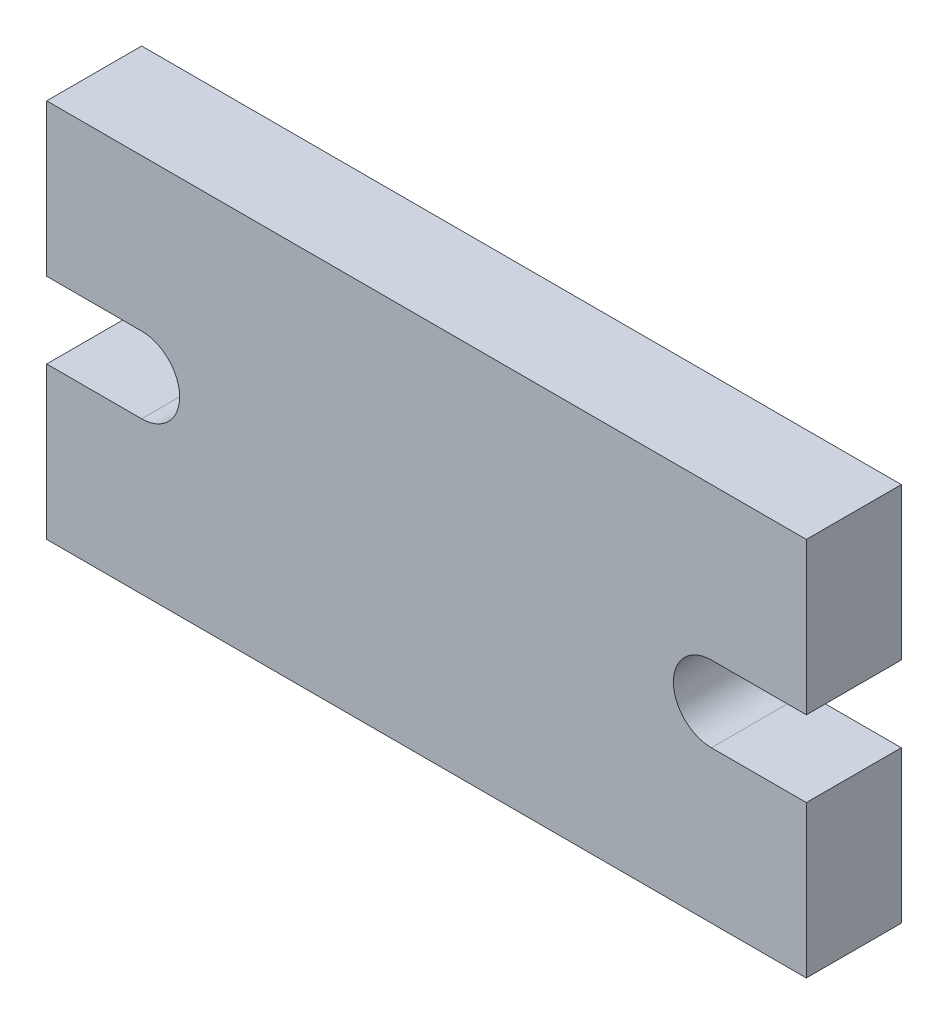
ISO-10303-21;
HEADER;
FILE_DESCRIPTION(('STEP AP214'),'2;1');
FILE_NAME('part.step','',(''),(''),'','','');
FILE_SCHEMA(('AUTOMOTIVE_DESIGN { 1 0 10303 214 1 1 1 1 }'));
ENDSEC;
DATA;
#1=APPLICATION_CONTEXT('core data for automotive mechanical design processes');
#2=APPLICATION_PROTOCOL_DEFINITION('international standard','automotive_design',2000,#1);
#3=PRODUCT_CONTEXT('',#1,'mechanical');
#4=PRODUCT('Part','Part','',(#3));
#5=PRODUCT_RELATED_PRODUCT_CATEGORY('part','',(#4));
#6=PRODUCT_DEFINITION_FORMATION('','',#4);
#7=PRODUCT_DEFINITION_CONTEXT('part definition',#1,'design');
#8=PRODUCT_DEFINITION('design','',#6,#7);
#9=PRODUCT_DEFINITION_SHAPE('','',#8);
#10=(LENGTH_UNIT() NAMED_UNIT(*) SI_UNIT(.MILLI.,.METRE.));
#11=(NAMED_UNIT(*) PLANE_ANGLE_UNIT() SI_UNIT($,.RADIAN.));
#12=(NAMED_UNIT(*) SI_UNIT($,.STERADIAN.) SOLID_ANGLE_UNIT());
#13=UNCERTAINTY_MEASURE_WITH_UNIT(LENGTH_MEASURE(1.E-05),#10,'distance_accuracy_value','');
#14=(GEOMETRIC_REPRESENTATION_CONTEXT(3) GLOBAL_UNCERTAINTY_ASSIGNED_CONTEXT((#13)) GLOBAL_UNIT_ASSIGNED_CONTEXT((#10,
#11,#12)) REPRESENTATION_CONTEXT('',''));
#15=CARTESIAN_POINT('',(0.,0.,0.));
#16=DIRECTION('',(0.,0.,1.));
#17=DIRECTION('',(1.,0.,0.));
#18=AXIS2_PLACEMENT_3D('',#15,#16,#17);
#19=CARTESIAN_POINT('',(-20.3846153846153,11.6346153846154,5.));
#20=DIRECTION('',(1.,0.,0.));
#21=DIRECTION('',(0.,1.,0.));
#22=AXIS2_PLACEMENT_3D('',#19,#20,#21);
#23=PLANE('',#22);
#24=DIRECTION('',(0.,-1.,0.));
#25=VECTOR('',#24,1.);
#26=CARTESIAN_POINT('',(-20.3846153846153,11.6346153846154,0.));
#27=LINE('',#26,#25);
#28=CARTESIAN_POINT('',(-20.3846153846153,11.6346153846154,0.));
#29=VERTEX_POINT('',#28);
#30=CARTESIAN_POINT('',(-20.3846153846153,3.63461538461538,0.));
#31=VERTEX_POINT('',#30);
#32=EDGE_CURVE('E153',#29,#31,#27,.T.);
#33=ORIENTED_EDGE('',*,*,#32,.T.);
#34=DIRECTION('',(0.,0.,-1.));
#35=VECTOR('',#34,1.);
#36=CARTESIAN_POINT('',(-20.3846153846153,3.63461538461538,5.));
#37=LINE('',#36,#35);
#38=CARTESIAN_POINT('',(-20.3846153846153,3.63461538461538,5.));
#39=VERTEX_POINT('',#38);
#40=EDGE_CURVE('E11',#39,#31,#37,.T.);
#41=ORIENTED_EDGE('',*,*,#40,.F.);
#42=DIRECTION('',(0.,-1.,0.));
#43=VECTOR('',#42,1.);
#44=CARTESIAN_POINT('',(-20.3846153846153,11.6346153846154,5.));
#45=LINE('',#44,#43);
#46=CARTESIAN_POINT('',(-20.3846153846153,11.6346153846154,5.));
#47=VERTEX_POINT('',#46);
#48=EDGE_CURVE('E175',#47,#39,#45,.T.);
#49=ORIENTED_EDGE('',*,*,#48,.F.);
#50=DIRECTION('',(0.,0.,-1.));
#51=VECTOR('',#50,1.);
#52=CARTESIAN_POINT('',(-20.3846153846153,11.6346153846154,5.));
#53=LINE('',#52,#51);
#54=EDGE_CURVE('E149',#47,#29,#53,.T.);
#55=ORIENTED_EDGE('',*,*,#54,.T.);
#56=EDGE_LOOP('',(#33,#41,#49,#55));
#57=FACE_BOUND('',#56,.T.);
#58=ADVANCED_FACE('F33',(#57),#23,.F.);
#59=CARTESIAN_POINT('',(-20.3846153846153,3.63461538461538,5.));
#60=DIRECTION('',(0.,1.,0.));
#61=DIRECTION('',(0.,0.,1.));
#62=AXIS2_PLACEMENT_3D('',#59,#60,#61);
#63=PLANE('',#62);
#64=DIRECTION('',(1.,0.,0.));
#65=VECTOR('',#64,1.);
#66=CARTESIAN_POINT('',(-20.3846153846153,3.63461538461538,0.));
#67=LINE('',#66,#65);
#68=CARTESIAN_POINT('',(-15.3846153846153,3.63461538461538,0.));
#69=VERTEX_POINT('',#68);
#70=EDGE_CURVE('E156',#31,#69,#67,.T.);
#71=ORIENTED_EDGE('',*,*,#70,.T.);
#72=DIRECTION('',(0.,0.,-1.));
#73=VECTOR('',#72,1.);
#74=CARTESIAN_POINT('',(-15.3846153846153,3.63461538461538,5.));
#75=LINE('',#74,#73);
#76=CARTESIAN_POINT('',(-15.3846153846153,3.63461538461538,5.));
#77=VERTEX_POINT('',#76);
#78=EDGE_CURVE('E41',#77,#69,#75,.T.);
#79=ORIENTED_EDGE('',*,*,#78,.F.);
#80=DIRECTION('',(1.,0.,0.));
#81=VECTOR('',#80,1.);
#82=CARTESIAN_POINT('',(-20.3846153846153,3.63461538461538,5.));
#83=LINE('',#82,#81);
#84=EDGE_CURVE('E104',#39,#77,#83,.T.);
#85=ORIENTED_EDGE('',*,*,#84,.F.);
#86=ORIENTED_EDGE('',*,*,#40,.T.);
#87=EDGE_LOOP('',(#71,#79,#85,#86));
#88=FACE_BOUND('',#87,.T.);
#89=ADVANCED_FACE('F253',(#88),#63,.F.);
#90=CARTESIAN_POINT('',(-15.3846153846153,1.63461538461538,5.));
#91=DIRECTION('',(0.,0.,-1.));
#92=DIRECTION('',(-1.,0.,0.));
#93=AXIS2_PLACEMENT_3D('',#90,#91,#92);
#94=CYLINDRICAL_SURFACE('',#93,2.);
#95=CARTESIAN_POINT('',(-15.3846153846153,1.63461538461538,0.));
#96=DIRECTION('',(0.,0.,-1.));
#97=DIRECTION('',(1.,0.,0.));
#98=AXIS2_PLACEMENT_3D('',#95,#96,#97);
#99=CIRCLE('',#98,2.);
#100=CARTESIAN_POINT('',(-15.3846153846153,-0.36538461538462,0.));
#101=VERTEX_POINT('',#100);
#102=EDGE_CURVE('E158',#69,#101,#99,.T.);
#103=ORIENTED_EDGE('',*,*,#102,.T.);
#104=DIRECTION('',(0.,0.,-1.));
#105=VECTOR('',#104,1.);
#106=CARTESIAN_POINT('',(-15.3846153846153,-0.36538461538462,5.));
#107=LINE('',#106,#105);
#108=CARTESIAN_POINT('',(-15.3846153846153,-0.36538461538462,5.));
#109=VERTEX_POINT('',#108);
#110=EDGE_CURVE('E194',#109,#101,#107,.T.);
#111=ORIENTED_EDGE('',*,*,#110,.F.);
#112=CARTESIAN_POINT('',(-15.3846153846153,1.63461538461538,5.));
#113=DIRECTION('',(0.,0.,-1.));
#114=DIRECTION('',(1.,0.,0.));
#115=AXIS2_PLACEMENT_3D('',#112,#113,#114);
#116=CIRCLE('',#115,2.);
#117=EDGE_CURVE('E202',#77,#109,#116,.T.);
#118=ORIENTED_EDGE('',*,*,#117,.F.);
#119=ORIENTED_EDGE('',*,*,#78,.T.);
#120=EDGE_LOOP('',(#103,#111,#118,#119));
#121=FACE_BOUND('',#120,.T.);
#122=ADVANCED_FACE('F200',(#121),#94,.F.);
#123=CARTESIAN_POINT('',(-20.3846153846153,-0.36538461538462,5.));
#124=DIRECTION('',(0.,-1.,0.));
#125=DIRECTION('',(0.,0.,-1.));
#126=AXIS2_PLACEMENT_3D('',#123,#124,#125);
#127=PLANE('',#126);
#128=DIRECTION('',(-1.,0.,0.));
#129=VECTOR('',#128,1.);
#130=CARTESIAN_POINT('',(-20.3846153846153,-0.36538461538462,0.));
#131=LINE('',#130,#129);
#132=CARTESIAN_POINT('',(-20.3846153846153,-0.36538461538462,0.));
#133=VERTEX_POINT('',#132);
#134=EDGE_CURVE('E160',#101,#133,#131,.T.);
#135=ORIENTED_EDGE('',*,*,#134,.T.);
#136=DIRECTION('',(0.,0.,-1.));
#137=VECTOR('',#136,1.);
#138=CARTESIAN_POINT('',(-20.3846153846153,-0.36538461538462,5.));
#139=LINE('',#138,#137);
#140=CARTESIAN_POINT('',(-20.3846153846153,-0.36538461538462,5.));
#141=VERTEX_POINT('',#140);
#142=EDGE_CURVE('E191',#141,#133,#139,.T.);
#143=ORIENTED_EDGE('',*,*,#142,.F.);
#144=DIRECTION('',(-1.,0.,0.));
#145=VECTOR('',#144,1.);
#146=CARTESIAN_POINT('',(-20.3846153846153,-0.36538461538462,5.));
#147=LINE('',#146,#145);
#148=EDGE_CURVE('E220',#109,#141,#147,.T.);
#149=ORIENTED_EDGE('',*,*,#148,.F.);
#150=ORIENTED_EDGE('',*,*,#110,.T.);
#151=EDGE_LOOP('',(#135,#143,#149,#150));
#152=FACE_BOUND('',#151,.T.);
#153=ADVANCED_FACE('F211',(#152),#127,.F.);
#154=CARTESIAN_POINT('',(-20.3846153846153,-0.36538461538462,5.));
#155=DIRECTION('',(1.,0.,0.));
#156=DIRECTION('',(0.,0.,-1.));
#157=AXIS2_PLACEMENT_3D('',#154,#155,#156);
#158=PLANE('',#157);
#159=DIRECTION('',(0.,-1.,0.));
#160=VECTOR('',#159,1.);
#161=CARTESIAN_POINT('',(-20.3846153846153,-0.36538461538462,0.));
#162=LINE('',#161,#160);
#163=CARTESIAN_POINT('',(-20.3846153846153,-8.36538461538462,0.));
#164=VERTEX_POINT('',#163);
#165=EDGE_CURVE('E162',#133,#164,#162,.T.);
#166=ORIENTED_EDGE('',*,*,#165,.T.);
#167=DIRECTION('',(0.,0.,-1.));
#168=VECTOR('',#167,1.);
#169=CARTESIAN_POINT('',(-20.3846153846153,-8.36538461538462,5.));
#170=LINE('',#169,#168);
#171=CARTESIAN_POINT('',(-20.3846153846153,-8.36538461538462,5.));
#172=VERTEX_POINT('',#171);
#173=EDGE_CURVE('E188',#172,#164,#170,.T.);
#174=ORIENTED_EDGE('',*,*,#173,.F.);
#175=DIRECTION('',(0.,-1.,0.));
#176=VECTOR('',#175,1.);
#177=CARTESIAN_POINT('',(-20.3846153846153,-0.36538461538462,5.));
#178=LINE('',#177,#176);
#179=EDGE_CURVE('E217',#141,#172,#178,.T.);
#180=ORIENTED_EDGE('',*,*,#179,.F.);
#181=ORIENTED_EDGE('',*,*,#142,.T.);
#182=EDGE_LOOP('',(#166,#174,#180,#181));
#183=FACE_BOUND('',#182,.T.);
#184=ADVANCED_FACE('F215',(#183),#158,.F.);
#185=CARTESIAN_POINT('',(-20.3846153846153,-8.36538461538462,5.));
#186=DIRECTION('',(0.,1.,0.));
#187=DIRECTION('',(0.,0.,1.));
#188=AXIS2_PLACEMENT_3D('',#185,#186,#187);
#189=PLANE('',#188);
#190=DIRECTION('',(1.,0.,0.));
#191=VECTOR('',#190,1.);
#192=CARTESIAN_POINT('',(-20.3846153846153,-8.36538461538462,0.));
#193=LINE('',#192,#191);
#194=CARTESIAN_POINT('',(19.6153846153847,-8.36538461538462,0.));
#195=VERTEX_POINT('',#194);
#196=EDGE_CURVE('E164',#164,#195,#193,.T.);
#197=ORIENTED_EDGE('',*,*,#196,.T.);
#198=DIRECTION('',(0.,0.,-1.));
#199=VECTOR('',#198,1.);
#200=CARTESIAN_POINT('',(19.6153846153847,-8.36538461538462,5.));
#201=LINE('',#200,#199);
#202=CARTESIAN_POINT('',(19.6153846153847,-8.36538461538462,5.));
#203=VERTEX_POINT('',#202);
#204=EDGE_CURVE('E185',#203,#195,#201,.T.);
#205=ORIENTED_EDGE('',*,*,#204,.F.);
#206=DIRECTION('',(1.,0.,0.));
#207=VECTOR('',#206,1.);
#208=CARTESIAN_POINT('',(-20.3846153846153,-8.36538461538462,5.));
#209=LINE('',#208,#207);
#210=EDGE_CURVE('E219',#172,#203,#209,.T.);
#211=ORIENTED_EDGE('',*,*,#210,.F.);
#212=ORIENTED_EDGE('',*,*,#173,.T.);
#213=EDGE_LOOP('',(#197,#205,#211,#212));
#214=FACE_BOUND('',#213,.T.);
#215=ADVANCED_FACE('F266',(#214),#189,.F.);
#216=CARTESIAN_POINT('',(19.6153846153847,-0.365384615384613,5.));
#217=DIRECTION('',(-1.,0.,0.));
#218=DIRECTION('',(0.,-1.,0.));
#219=AXIS2_PLACEMENT_3D('',#216,#217,#218);
#220=PLANE('',#219);
#221=DIRECTION('',(0.,1.,0.));
#222=VECTOR('',#221,1.);
#223=CARTESIAN_POINT('',(19.6153846153847,-0.365384615384613,0.));
#224=LINE('',#223,#222);
#225=CARTESIAN_POINT('',(19.6153846153847,-0.365384615384613,0.));
#226=VERTEX_POINT('',#225);
#227=EDGE_CURVE('E166',#195,#226,#224,.T.);
#228=ORIENTED_EDGE('',*,*,#227,.T.);
#229=DIRECTION('',(0.,0.,-1.));
#230=VECTOR('',#229,1.);
#231=CARTESIAN_POINT('',(19.6153846153847,-0.365384615384613,5.));
#232=LINE('',#231,#230);
#233=CARTESIAN_POINT('',(19.6153846153847,-0.365384615384613,5.));
#234=VERTEX_POINT('',#233);
#235=EDGE_CURVE('E182',#234,#226,#232,.T.);
#236=ORIENTED_EDGE('',*,*,#235,.F.);
#237=DIRECTION('',(0.,1.,0.));
#238=VECTOR('',#237,1.);
#239=CARTESIAN_POINT('',(19.6153846153847,-0.365384615384613,5.));
#240=LINE('',#239,#238);
#241=EDGE_CURVE('E222',#203,#234,#240,.T.);
#242=ORIENTED_EDGE('',*,*,#241,.F.);
#243=ORIENTED_EDGE('',*,*,#204,.T.);
#244=EDGE_LOOP('',(#228,#236,#242,#243));
#245=FACE_BOUND('',#244,.T.);
#246=ADVANCED_FACE('F269',(#245),#220,.F.);
#247=CARTESIAN_POINT('',(19.6153846153847,-0.365384615384613,5.));
#248=DIRECTION('',(0.,-1.,0.));
#249=DIRECTION('',(1.,0.,0.));
#250=AXIS2_PLACEMENT_3D('',#247,#248,#249);
#251=PLANE('',#250);
#252=DIRECTION('',(-1.,0.,0.));
#253=VECTOR('',#252,1.);
#254=CARTESIAN_POINT('',(19.6153846153847,-0.365384615384613,0.));
#255=LINE('',#254,#253);
#256=CARTESIAN_POINT('',(14.6153846153847,-0.365384615384616,0.));
#257=VERTEX_POINT('',#256);
#258=EDGE_CURVE('E168',#226,#257,#255,.T.);
#259=ORIENTED_EDGE('',*,*,#258,.T.);
#260=DIRECTION('',(0.,0.,-1.));
#261=VECTOR('',#260,1.);
#262=CARTESIAN_POINT('',(14.6153846153847,-0.365384615384616,5.));
#263=LINE('',#262,#261);
#264=CARTESIAN_POINT('',(14.6153846153847,-0.365384615384616,5.));
#265=VERTEX_POINT('',#264);
#266=EDGE_CURVE('E179',#265,#257,#263,.T.);
#267=ORIENTED_EDGE('',*,*,#266,.F.);
#268=DIRECTION('',(-1.,0.,0.));
#269=VECTOR('',#268,1.);
#270=CARTESIAN_POINT('',(19.6153846153847,-0.365384615384613,5.));
#271=LINE('',#270,#269);
#272=EDGE_CURVE('E228',#234,#265,#271,.T.);
#273=ORIENTED_EDGE('',*,*,#272,.F.);
#274=ORIENTED_EDGE('',*,*,#235,.T.);
#275=EDGE_LOOP('',(#259,#267,#273,#274));
#276=FACE_BOUND('',#275,.T.);
#277=ADVANCED_FACE('F234',(#276),#251,.F.);
#278=CARTESIAN_POINT('',(14.6153846153847,1.63461538461538,5.));
#279=DIRECTION('',(0.,0.,-1.));
#280=DIRECTION('',(-1.,0.,0.));
#281=AXIS2_PLACEMENT_3D('',#278,#279,#280);
#282=CYLINDRICAL_SURFACE('',#281,2.);
#283=CARTESIAN_POINT('',(14.6153846153847,1.63461538461538,0.));
#284=DIRECTION('',(0.,0.,-1.));
#285=DIRECTION('',(-1.,0.,0.));
#286=AXIS2_PLACEMENT_3D('',#283,#284,#285);
#287=CIRCLE('',#286,2.);
#288=CARTESIAN_POINT('',(14.6153846153847,3.63461538461538,0.));
#289=VERTEX_POINT('',#288);
#290=EDGE_CURVE('E170',#257,#289,#287,.T.);
#291=ORIENTED_EDGE('',*,*,#290,.T.);
#292=DIRECTION('',(0.,0.,-1.));
#293=VECTOR('',#292,1.);
#294=CARTESIAN_POINT('',(14.6153846153847,3.63461538461538,5.));
#295=LINE('',#294,#293);
#296=CARTESIAN_POINT('',(14.6153846153847,3.63461538461538,5.));
#297=VERTEX_POINT('',#296);
#298=EDGE_CURVE('E144',#297,#289,#295,.T.);
#299=ORIENTED_EDGE('',*,*,#298,.F.);
#300=CARTESIAN_POINT('',(14.6153846153847,1.63461538461538,5.));
#301=DIRECTION('',(0.,0.,-1.));
#302=DIRECTION('',(-1.,0.,0.));
#303=AXIS2_PLACEMENT_3D('',#300,#301,#302);
#304=CIRCLE('',#303,2.);
#305=EDGE_CURVE('E135',#265,#297,#304,.T.);
#306=ORIENTED_EDGE('',*,*,#305,.F.);
#307=ORIENTED_EDGE('',*,*,#266,.T.);
#308=EDGE_LOOP('',(#291,#299,#306,#307));
#309=FACE_BOUND('',#308,.T.);
#310=ADVANCED_FACE('F238',(#309),#282,.F.);
#311=CARTESIAN_POINT('',(19.6153846153846,3.63461538461539,5.));
#312=DIRECTION('',(0.,1.,0.));
#313=DIRECTION('',(-1.,0.,0.));
#314=AXIS2_PLACEMENT_3D('',#311,#312,#313);
#315=PLANE('',#314);
#316=DIRECTION('',(1.,0.,0.));
#317=VECTOR('',#316,1.);
#318=CARTESIAN_POINT('',(19.6153846153846,3.63461538461539,0.));
#319=LINE('',#318,#317);
#320=CARTESIAN_POINT('',(19.6153846153846,3.63461538461539,0.));
#321=VERTEX_POINT('',#320);
#322=EDGE_CURVE('E143',#289,#321,#319,.T.);
#323=ORIENTED_EDGE('',*,*,#322,.T.);
#324=DIRECTION('',(0.,0.,-1.));
#325=VECTOR('',#324,1.);
#326=CARTESIAN_POINT('',(19.6153846153846,3.63461538461539,5.));
#327=LINE('',#326,#325);
#328=CARTESIAN_POINT('',(19.6153846153846,3.63461538461539,5.));
#329=VERTEX_POINT('',#328);
#330=EDGE_CURVE('E140',#329,#321,#327,.T.);
#331=ORIENTED_EDGE('',*,*,#330,.F.);
#332=DIRECTION('',(1.,0.,0.));
#333=VECTOR('',#332,1.);
#334=CARTESIAN_POINT('',(19.6153846153846,3.63461538461539,5.));
#335=LINE('',#334,#333);
#336=EDGE_CURVE('E129',#297,#329,#335,.T.);
#337=ORIENTED_EDGE('',*,*,#336,.F.);
#338=ORIENTED_EDGE('',*,*,#298,.T.);
#339=EDGE_LOOP('',(#323,#331,#337,#338));
#340=FACE_BOUND('',#339,.T.);
#341=ADVANCED_FACE('F141',(#340),#315,.F.);
#342=CARTESIAN_POINT('',(19.6153846153847,11.6346153846154,5.));
#343=DIRECTION('',(-1.,0.,0.));
#344=DIRECTION('',(0.,-1.,0.));
#345=AXIS2_PLACEMENT_3D('',#342,#343,#344);
#346=PLANE('',#345);
#347=DIRECTION('',(0.,1.,0.));
#348=VECTOR('',#347,1.);
#349=CARTESIAN_POINT('',(19.6153846153847,11.6346153846154,0.));
#350=LINE('',#349,#348);
#351=CARTESIAN_POINT('',(19.6153846153847,11.6346153846154,0.));
#352=VERTEX_POINT('',#351);
#353=EDGE_CURVE('E90',#321,#352,#350,.T.);
#354=ORIENTED_EDGE('',*,*,#353,.T.);
#355=DIRECTION('',(0.,0.,-1.));
#356=VECTOR('',#355,1.);
#357=CARTESIAN_POINT('',(19.6153846153847,11.6346153846154,5.));
#358=LINE('',#357,#356);
#359=CARTESIAN_POINT('',(19.6153846153847,11.6346153846154,5.));
#360=VERTEX_POINT('',#359);
#361=EDGE_CURVE('E145',#360,#352,#358,.T.);
#362=ORIENTED_EDGE('',*,*,#361,.F.);
#363=DIRECTION('',(0.,1.,0.));
#364=VECTOR('',#363,1.);
#365=CARTESIAN_POINT('',(19.6153846153847,11.6346153846154,5.));
#366=LINE('',#365,#364);
#367=EDGE_CURVE('E133',#329,#360,#366,.T.);
#368=ORIENTED_EDGE('',*,*,#367,.F.);
#369=ORIENTED_EDGE('',*,*,#330,.T.);
#370=EDGE_LOOP('',(#354,#362,#368,#369));
#371=FACE_BOUND('',#370,.T.);
#372=ADVANCED_FACE('F147',(#371),#346,.F.);
#373=CARTESIAN_POINT('',(-20.3846153846153,11.6346153846154,5.));
#374=DIRECTION('',(0.,-1.,0.));
#375=DIRECTION('',(0.,0.,-1.));
#376=AXIS2_PLACEMENT_3D('',#373,#374,#375);
#377=PLANE('',#376);
#378=DIRECTION('',(-1.,0.,0.));
#379=VECTOR('',#378,1.);
#380=CARTESIAN_POINT('',(-20.3846153846153,11.6346153846154,0.));
#381=LINE('',#380,#379);
#382=EDGE_CURVE('E96',#352,#29,#381,.T.);
#383=ORIENTED_EDGE('',*,*,#382,.T.);
#384=ORIENTED_EDGE('',*,*,#54,.F.);
#385=DIRECTION('',(-1.,0.,0.));
#386=VECTOR('',#385,1.);
#387=CARTESIAN_POINT('',(-20.3846153846153,11.6346153846154,5.));
#388=LINE('',#387,#386);
#389=EDGE_CURVE('E49',#360,#47,#388,.T.);
#390=ORIENTED_EDGE('',*,*,#389,.F.);
#391=ORIENTED_EDGE('',*,*,#361,.T.);
#392=EDGE_LOOP('',(#383,#384,#390,#391));
#393=FACE_BOUND('',#392,.T.);
#394=ADVANCED_FACE('F242',(#393),#377,.F.);
#395=CARTESIAN_POINT('',(-15.3846153846153,1.63461538461538,5.));
#396=DIRECTION('',(0.,0.,1.));
#397=DIRECTION('',(1.,0.,0.));
#398=AXIS2_PLACEMENT_3D('',#395,#396,#397);
#399=PLANE('',#398);
#400=ORIENTED_EDGE('',*,*,#48,.T.);
#401=ORIENTED_EDGE('',*,*,#84,.T.);
#402=ORIENTED_EDGE('',*,*,#117,.T.);
#403=ORIENTED_EDGE('',*,*,#148,.T.);
#404=ORIENTED_EDGE('',*,*,#179,.T.);
#405=ORIENTED_EDGE('',*,*,#210,.T.);
#406=ORIENTED_EDGE('',*,*,#241,.T.);
#407=ORIENTED_EDGE('',*,*,#272,.T.);
#408=ORIENTED_EDGE('',*,*,#305,.T.);
#409=ORIENTED_EDGE('',*,*,#336,.T.);
#410=ORIENTED_EDGE('',*,*,#367,.T.);
#411=ORIENTED_EDGE('',*,*,#389,.T.);
#412=EDGE_LOOP('',(#400,#401,#402,#403,#404,#405,#406,#407,#408,#409,#410,#411));
#413=FACE_BOUND('',#412,.T.);
#414=ADVANCED_FACE('F131',(#413),#399,.T.);
#415=CARTESIAN_POINT('',(-15.3846153846153,1.63461538461538,0.));
#416=DIRECTION('',(0.,0.,1.));
#417=DIRECTION('',(1.,0.,0.));
#418=AXIS2_PLACEMENT_3D('',#415,#416,#417);
#419=PLANE('',#418);
#420=ORIENTED_EDGE('',*,*,#32,.F.);
#421=ORIENTED_EDGE('',*,*,#382,.F.);
#422=ORIENTED_EDGE('',*,*,#353,.F.);
#423=ORIENTED_EDGE('',*,*,#322,.F.);
#424=ORIENTED_EDGE('',*,*,#290,.F.);
#425=ORIENTED_EDGE('',*,*,#258,.F.);
#426=ORIENTED_EDGE('',*,*,#227,.F.);
#427=ORIENTED_EDGE('',*,*,#196,.F.);
#428=ORIENTED_EDGE('',*,*,#165,.F.);
#429=ORIENTED_EDGE('',*,*,#134,.F.);
#430=ORIENTED_EDGE('',*,*,#102,.F.);
#431=ORIENTED_EDGE('',*,*,#70,.F.);
#432=EDGE_LOOP('',(#420,#421,#422,#423,#424,#425,#426,#427,#428,#429,#430,#431));
#433=FACE_BOUND('',#432,.T.);
#434=ADVANCED_FACE('F206',(#433),#419,.F.);
#435=CLOSED_SHELL('',(#58,#89,#122,#153,#184,#215,#246,#277,#310,#341,#372,#394,#414,#434));
#436=MANIFOLD_SOLID_BREP('B2',#435);
#437=ADVANCED_BREP_SHAPE_REPRESENTATION('',(#18,#436),#14);
#438=SHAPE_DEFINITION_REPRESENTATION(#9,#437);
ENDSEC;
END-ISO-10303-21;
